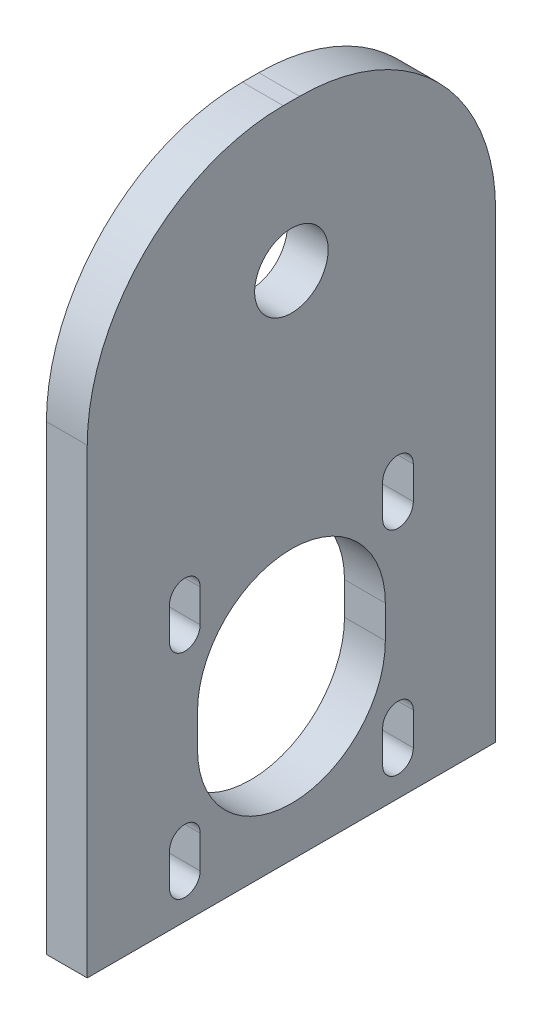
ISO-10303-21;
HEADER;
FILE_DESCRIPTION(('STEP AP214'),'2;1');
FILE_NAME('part.step','',(''),(''),'','','');
FILE_SCHEMA(('AUTOMOTIVE_DESIGN { 1 0 10303 214 1 1 1 1 }'));
ENDSEC;
DATA;
#1=APPLICATION_CONTEXT('core data for automotive mechanical design processes');
#2=APPLICATION_PROTOCOL_DEFINITION('international standard','automotive_design',2000,#1);
#3=PRODUCT_CONTEXT('',#1,'mechanical');
#4=PRODUCT('Part','Part','',(#3));
#5=PRODUCT_RELATED_PRODUCT_CATEGORY('part','',(#4));
#6=PRODUCT_DEFINITION_FORMATION('','',#4);
#7=PRODUCT_DEFINITION_CONTEXT('part definition',#1,'design');
#8=PRODUCT_DEFINITION('design','',#6,#7);
#9=PRODUCT_DEFINITION_SHAPE('','',#8);
#10=(LENGTH_UNIT() NAMED_UNIT(*) SI_UNIT(.MILLI.,.METRE.));
#11=(NAMED_UNIT(*) PLANE_ANGLE_UNIT() SI_UNIT($,.RADIAN.));
#12=(NAMED_UNIT(*) SI_UNIT($,.STERADIAN.) SOLID_ANGLE_UNIT());
#13=UNCERTAINTY_MEASURE_WITH_UNIT(LENGTH_MEASURE(1.E-05),#10,'distance_accuracy_value','');
#14=(GEOMETRIC_REPRESENTATION_CONTEXT(3) GLOBAL_UNCERTAINTY_ASSIGNED_CONTEXT((#13)) GLOBAL_UNIT_ASSIGNED_CONTEXT((#10,
#11,#12)) REPRESENTATION_CONTEXT('',''));
#15=CARTESIAN_POINT('',(0.,0.,0.));
#16=DIRECTION('',(0.,0.,1.));
#17=DIRECTION('',(1.,0.,0.));
#18=AXIS2_PLACEMENT_3D('',#15,#16,#17);
#19=CARTESIAN_POINT('',(5.,-4.80862533692693,-9.3733715800595));
#20=DIRECTION('',(1.,0.,0.));
#21=DIRECTION('',(0.,0.,-1.));
#22=AXIS2_PLACEMENT_3D('',#19,#20,#21);
#23=PLANE('',#22);
#24=DIRECTION('',(0.,1.,0.));
#25=VECTOR('',#24,1.);
#26=CARTESIAN_POINT('',(5.,-4.80862533692693,-35.3733715800595));
#27=LINE('',#26,#25);
#28=CARTESIAN_POINT('',(5.,-61.3086253369269,-35.3733715800595));
#29=VERTEX_POINT('',#28);
#30=CARTESIAN_POINT('',(5.,-4.80862533692693,-35.3733715800595));
#31=VERTEX_POINT('',#30);
#32=EDGE_CURVE('E373',#29,#31,#27,.T.);
#33=ORIENTED_EDGE('',*,*,#32,.T.);
#34=CARTESIAN_POINT('',(5.,-4.80862533692693,-11.3733715800595));
#35=DIRECTION('',(1.,0.,0.));
#36=DIRECTION('',(0.,0.,1.));
#37=AXIS2_PLACEMENT_3D('',#34,#35,#36);
#38=CIRCLE('',#37,24.);
#39=CARTESIAN_POINT('',(5.,19.1913746630731,-11.3733715800595));
#40=VERTEX_POINT('',#39);
#41=EDGE_CURVE('E376',#31,#40,#38,.T.);
#42=ORIENTED_EDGE('',*,*,#41,.T.);
#43=DIRECTION('',(0.,0.,1.));
#44=VECTOR('',#43,1.);
#45=CARTESIAN_POINT('',(5.,19.1913746630731,-9.3733715800595));
#46=LINE('',#45,#44);
#47=CARTESIAN_POINT('',(5.,19.1913746630731,-9.3733715800595));
#48=VERTEX_POINT('',#47);
#49=EDGE_CURVE('E379',#40,#48,#46,.T.);
#50=ORIENTED_EDGE('',*,*,#49,.T.);
#51=CARTESIAN_POINT('',(5.,-4.80862533692693,-9.3733715800595));
#52=DIRECTION('',(1.,0.,0.));
#53=DIRECTION('',(0.,0.,-1.));
#54=AXIS2_PLACEMENT_3D('',#51,#52,#53);
#55=CIRCLE('',#54,24.);
#56=CARTESIAN_POINT('',(5.,-4.80862533692693,14.6266284199405));
#57=VERTEX_POINT('',#56);
#58=EDGE_CURVE('E381',#48,#57,#55,.T.);
#59=ORIENTED_EDGE('',*,*,#58,.T.);
#60=DIRECTION('',(0.,-1.,0.));
#61=VECTOR('',#60,1.);
#62=CARTESIAN_POINT('',(5.,-4.80862533692693,14.6266284199405));
#63=LINE('',#62,#61);
#64=CARTESIAN_POINT('',(5.,-61.3086253369269,14.6266284199405));
#65=VERTEX_POINT('',#64);
#66=EDGE_CURVE('E383',#57,#65,#63,.T.);
#67=ORIENTED_EDGE('',*,*,#66,.T.);
#68=DIRECTION('',(0.,0.,-1.));
#69=VECTOR('',#68,1.);
#70=CARTESIAN_POINT('',(5.,-61.3086253369269,14.6266284199405));
#71=LINE('',#70,#69);
#72=EDGE_CURVE('E385',#65,#29,#71,.T.);
#73=ORIENTED_EDGE('',*,*,#72,.T.);
#74=EDGE_LOOP('',(#33,#42,#50,#59,#67,#73));
#75=FACE_BOUND('',#74,.T.);
#76=CARTESIAN_POINT('',(5.,1.19137466307307,-10.3733715800595));
#77=DIRECTION('',(1.,0.,0.));
#78=DIRECTION('',(0.,0.,-1.));
#79=AXIS2_PLACEMENT_3D('',#76,#77,#78);
#80=CIRCLE('',#79,4.5);
#81=CARTESIAN_POINT('',(5.,1.19137466307307,-14.8733715800595));
#82=VERTEX_POINT('',#81);
#83=EDGE_CURVE('E367',#82,#82,#80,.T.);
#84=ORIENTED_EDGE('',*,*,#83,.F.);
#85=EDGE_LOOP('',(#84));
#86=FACE_BOUND('',#85,.T.);
#87=DIRECTION('',(0.,-1.,0.));
#88=VECTOR('',#87,1.);
#89=CARTESIAN_POINT('',(5.,-26.758625336927,4.55162841994051));
#90=LINE('',#89,#88);
#91=CARTESIAN_POINT('',(5.,-26.758625336927,4.55162841994051));
#92=VERTEX_POINT('',#91);
#93=CARTESIAN_POINT('',(5.,-30.7586253369269,4.55162841994051));
#94=VERTEX_POINT('',#93);
#95=EDGE_CURVE('E338',#92,#94,#90,.T.);
#96=ORIENTED_EDGE('',*,*,#95,.F.);
#97=CARTESIAN_POINT('',(5.,-26.758625336927,2.67662841994051));
#98=DIRECTION('',(1.,0.,0.));
#99=DIRECTION('',(0.,0.,-1.));
#100=AXIS2_PLACEMENT_3D('',#97,#98,#99);
#101=CIRCLE('',#100,1.875);
#102=CARTESIAN_POINT('',(5.,-26.758625336927,0.80162841994051));
#103=VERTEX_POINT('',#102);
#104=EDGE_CURVE('E336',#103,#92,#101,.T.);
#105=ORIENTED_EDGE('',*,*,#104,.F.);
#106=DIRECTION('',(0.,1.,0.));
#107=VECTOR('',#106,1.);
#108=CARTESIAN_POINT('',(5.,-26.758625336927,0.80162841994051));
#109=LINE('',#108,#107);
#110=CARTESIAN_POINT('',(5.,-30.758625336927,0.801628419940509));
#111=VERTEX_POINT('',#110);
#112=EDGE_CURVE('E344',#111,#103,#109,.T.);
#113=ORIENTED_EDGE('',*,*,#112,.F.);
#114=CARTESIAN_POINT('',(5.,-30.758625336927,2.6766284199405));
#115=DIRECTION('',(1.,0.,0.));
#116=DIRECTION('',(0.,0.,-1.));
#117=AXIS2_PLACEMENT_3D('',#114,#115,#116);
#118=CIRCLE('',#117,1.875);
#119=EDGE_CURVE('E341',#94,#111,#118,.T.);
#120=ORIENTED_EDGE('',*,*,#119,.F.);
#121=EDGE_LOOP('',(#96,#105,#113,#120));
#122=FACE_BOUND('',#121,.T.);
#123=DIRECTION('',(0.,-1.,0.));
#124=VECTOR('',#123,1.);
#125=CARTESIAN_POINT('',(5.,-26.7586253369269,-21.5483715800594));
#126=LINE('',#125,#124);
#127=CARTESIAN_POINT('',(5.,-26.7586253369269,-21.5483715800594));
#128=VERTEX_POINT('',#127);
#129=CARTESIAN_POINT('',(5.,-30.7586253369269,-21.5483715800595));
#130=VERTEX_POINT('',#129);
#131=EDGE_CURVE('E307',#128,#130,#126,.T.);
#132=ORIENTED_EDGE('',*,*,#131,.F.);
#133=CARTESIAN_POINT('',(5.,-26.7586253369269,-23.4233715800594));
#134=DIRECTION('',(1.,0.,0.));
#135=DIRECTION('',(0.,0.,-1.));
#136=AXIS2_PLACEMENT_3D('',#133,#134,#135);
#137=CIRCLE('',#136,1.87500000000001);
#138=CARTESIAN_POINT('',(5.,-26.7586253369269,-25.2983715800594));
#139=VERTEX_POINT('',#138);
#140=EDGE_CURVE('E305',#139,#128,#137,.T.);
#141=ORIENTED_EDGE('',*,*,#140,.F.);
#142=DIRECTION('',(0.,1.,0.));
#143=VECTOR('',#142,1.);
#144=CARTESIAN_POINT('',(5.,-26.7586253369269,-25.2983715800594));
#145=LINE('',#144,#143);
#146=CARTESIAN_POINT('',(5.,-30.7586253369269,-25.2983715800595));
#147=VERTEX_POINT('',#146);
#148=EDGE_CURVE('E313',#147,#139,#145,.T.);
#149=ORIENTED_EDGE('',*,*,#148,.F.);
#150=CARTESIAN_POINT('',(5.,-30.7586253369269,-23.4233715800594));
#151=DIRECTION('',(1.,0.,0.));
#152=DIRECTION('',(0.,0.,-1.));
#153=AXIS2_PLACEMENT_3D('',#150,#151,#152);
#154=CIRCLE('',#153,1.87500000000001);
#155=EDGE_CURVE('E310',#130,#147,#154,.T.);
#156=ORIENTED_EDGE('',*,*,#155,.F.);
#157=EDGE_LOOP('',(#132,#141,#149,#156));
#158=FACE_BOUND('',#157,.T.);
#159=DIRECTION('',(0.,-1.,0.));
#160=VECTOR('',#159,1.);
#161=CARTESIAN_POINT('',(5.,-52.858625336927,-21.5483715800595));
#162=LINE('',#161,#160);
#163=CARTESIAN_POINT('',(5.,-52.858625336927,-21.5483715800595));
#164=VERTEX_POINT('',#163);
#165=CARTESIAN_POINT('',(5.,-56.858625336927,-21.5483715800595));
#166=VERTEX_POINT('',#165);
#167=EDGE_CURVE('E276',#164,#166,#162,.T.);
#168=ORIENTED_EDGE('',*,*,#167,.F.);
#169=CARTESIAN_POINT('',(5.,-52.858625336927,-23.4233715800595));
#170=DIRECTION('',(1.,0.,0.));
#171=DIRECTION('',(0.,0.,-1.));
#172=AXIS2_PLACEMENT_3D('',#169,#170,#171);
#173=CIRCLE('',#172,1.875);
#174=CARTESIAN_POINT('',(5.,-52.858625336927,-25.2983715800595));
#175=VERTEX_POINT('',#174);
#176=EDGE_CURVE('E274',#175,#164,#173,.T.);
#177=ORIENTED_EDGE('',*,*,#176,.F.);
#178=DIRECTION('',(0.,1.,0.));
#179=VECTOR('',#178,1.);
#180=CARTESIAN_POINT('',(5.,-52.858625336927,-25.2983715800595));
#181=LINE('',#180,#179);
#182=CARTESIAN_POINT('',(5.,-56.858625336927,-25.2983715800595));
#183=VERTEX_POINT('',#182);
#184=EDGE_CURVE('E282',#183,#175,#181,.T.);
#185=ORIENTED_EDGE('',*,*,#184,.F.);
#186=CARTESIAN_POINT('',(5.,-56.858625336927,-23.4233715800595));
#187=DIRECTION('',(1.,0.,0.));
#188=DIRECTION('',(0.,0.,-1.));
#189=AXIS2_PLACEMENT_3D('',#186,#187,#188);
#190=CIRCLE('',#189,1.875);
#191=EDGE_CURVE('E279',#166,#183,#190,.T.);
#192=ORIENTED_EDGE('',*,*,#191,.F.);
#193=EDGE_LOOP('',(#168,#177,#185,#192));
#194=FACE_BOUND('',#193,.T.);
#195=DIRECTION('',(0.,-1.,0.));
#196=VECTOR('',#195,1.);
#197=CARTESIAN_POINT('',(5.,-52.858625336927,4.55162841994051));
#198=LINE('',#197,#196);
#199=CARTESIAN_POINT('',(5.,-52.858625336927,4.55162841994051));
#200=VERTEX_POINT('',#199);
#201=CARTESIAN_POINT('',(5.,-56.858625336927,4.55162841994051));
#202=VERTEX_POINT('',#201);
#203=EDGE_CURVE('E245',#200,#202,#198,.T.);
#204=ORIENTED_EDGE('',*,*,#203,.F.);
#205=CARTESIAN_POINT('',(5.,-52.858625336927,2.67662841994051));
#206=DIRECTION('',(1.,0.,0.));
#207=DIRECTION('',(0.,0.,-1.));
#208=AXIS2_PLACEMENT_3D('',#205,#206,#207);
#209=CIRCLE('',#208,1.875);
#210=CARTESIAN_POINT('',(5.,-52.858625336927,0.801628419940512));
#211=VERTEX_POINT('',#210);
#212=EDGE_CURVE('E243',#211,#200,#209,.T.);
#213=ORIENTED_EDGE('',*,*,#212,.F.);
#214=DIRECTION('',(0.,1.,0.));
#215=VECTOR('',#214,1.);
#216=CARTESIAN_POINT('',(5.,-52.858625336927,0.801628419940512));
#217=LINE('',#216,#215);
#218=CARTESIAN_POINT('',(5.,-56.858625336927,0.801628419940504));
#219=VERTEX_POINT('',#218);
#220=EDGE_CURVE('E251',#219,#211,#217,.T.);
#221=ORIENTED_EDGE('',*,*,#220,.F.);
#222=CARTESIAN_POINT('',(5.,-56.858625336927,2.6766284199405));
#223=DIRECTION('',(1.,0.,0.));
#224=DIRECTION('',(0.,0.,-1.));
#225=AXIS2_PLACEMENT_3D('',#222,#223,#224);
#226=CIRCLE('',#225,1.875);
#227=EDGE_CURVE('E248',#202,#219,#226,.T.);
#228=ORIENTED_EDGE('',*,*,#227,.F.);
#229=EDGE_LOOP('',(#204,#213,#221,#228));
#230=FACE_BOUND('',#229,.T.);
#231=DIRECTION('',(0.,-1.,0.));
#232=VECTOR('',#231,1.);
#233=CARTESIAN_POINT('',(5.,-39.808625336927,1.12662841994049));
#234=LINE('',#233,#232);
#235=CARTESIAN_POINT('',(5.,-39.808625336927,1.12662841994049));
#236=VERTEX_POINT('',#235);
#237=CARTESIAN_POINT('',(5.,-43.8086253369269,1.1266284199405));
#238=VERTEX_POINT('',#237);
#239=EDGE_CURVE('E213',#236,#238,#234,.T.);
#240=ORIENTED_EDGE('',*,*,#239,.F.);
#241=CARTESIAN_POINT('',(5.,-39.808625336927,-10.3733715800595));
#242=DIRECTION('',(1.,0.,0.));
#243=DIRECTION('',(0.,0.,-1.));
#244=AXIS2_PLACEMENT_3D('',#241,#242,#243);
#245=CIRCLE('',#244,11.5);
#246=CARTESIAN_POINT('',(5.,-39.808625336927,-21.8733715800595));
#247=VERTEX_POINT('',#246);
#248=EDGE_CURVE('E205',#247,#236,#245,.T.);
#249=ORIENTED_EDGE('',*,*,#248,.F.);
#250=DIRECTION('',(0.,1.,0.));
#251=VECTOR('',#250,1.);
#252=CARTESIAN_POINT('',(5.,-39.808625336927,-21.8733715800595));
#253=LINE('',#252,#251);
#254=CARTESIAN_POINT('',(5.,-43.8086253369269,-21.8733715800595));
#255=VERTEX_POINT('',#254);
#256=EDGE_CURVE('E227',#255,#247,#253,.T.);
#257=ORIENTED_EDGE('',*,*,#256,.F.);
#258=CARTESIAN_POINT('',(5.,-43.8086253369269,-10.3733715800595));
#259=DIRECTION('',(1.,0.,0.));
#260=DIRECTION('',(0.,0.,-1.));
#261=AXIS2_PLACEMENT_3D('',#258,#259,#260);
#262=CIRCLE('',#261,11.5);
#263=EDGE_CURVE('E225',#238,#255,#262,.T.);
#264=ORIENTED_EDGE('',*,*,#263,.F.);
#265=EDGE_LOOP('',(#240,#249,#257,#264));
#266=FACE_BOUND('',#265,.T.);
#267=ADVANCED_FACE('F32',(#75,#86,#122,#158,#194,#230,#266),#23,.T.);
#268=CARTESIAN_POINT('',(0.,-4.80862533692693,-9.3733715800595));
#269=DIRECTION('',(1.,0.,0.));
#270=DIRECTION('',(0.,0.,-1.));
#271=AXIS2_PLACEMENT_3D('',#268,#269,#270);
#272=PLANE('',#271);
#273=CARTESIAN_POINT('',(0.,-52.858625336927,2.67662841994051));
#274=DIRECTION('',(1.,0.,0.));
#275=DIRECTION('',(0.,0.,-1.));
#276=AXIS2_PLACEMENT_3D('',#273,#274,#275);
#277=CIRCLE('',#276,1.875);
#278=CARTESIAN_POINT('',(0.,-52.858625336927,0.801628419940512));
#279=VERTEX_POINT('',#278);
#280=CARTESIAN_POINT('',(0.,-52.858625336927,4.55162841994051));
#281=VERTEX_POINT('',#280);
#282=EDGE_CURVE('E221',#279,#281,#277,.T.);
#283=ORIENTED_EDGE('',*,*,#282,.T.);
#284=DIRECTION('',(0.,-1.,0.));
#285=VECTOR('',#284,1.);
#286=CARTESIAN_POINT('',(0.,-52.858625336927,4.55162841994051));
#287=LINE('',#286,#285);
#288=CARTESIAN_POINT('',(0.,-56.858625336927,4.55162841994051));
#289=VERTEX_POINT('',#288);
#290=EDGE_CURVE('E256',#281,#289,#287,.T.);
#291=ORIENTED_EDGE('',*,*,#290,.T.);
#292=CARTESIAN_POINT('',(0.,-56.858625336927,2.6766284199405));
#293=DIRECTION('',(1.,0.,0.));
#294=DIRECTION('',(0.,0.,-1.));
#295=AXIS2_PLACEMENT_3D('',#292,#293,#294);
#296=CIRCLE('',#295,1.875);
#297=CARTESIAN_POINT('',(0.,-56.858625336927,0.801628419940494));
#298=VERTEX_POINT('',#297);
#299=EDGE_CURVE('E259',#289,#298,#296,.T.);
#300=ORIENTED_EDGE('',*,*,#299,.T.);
#301=DIRECTION('',(0.,1.,0.));
#302=VECTOR('',#301,1.);
#303=CARTESIAN_POINT('',(0.,-52.858625336927,0.801628419940512));
#304=LINE('',#303,#302);
#305=EDGE_CURVE('E246',#298,#279,#304,.T.);
#306=ORIENTED_EDGE('',*,*,#305,.T.);
#307=EDGE_LOOP('',(#283,#291,#300,#306));
#308=FACE_BOUND('',#307,.T.);
#309=CARTESIAN_POINT('',(0.,-26.7586253369269,-23.4233715800594));
#310=DIRECTION('',(1.,0.,0.));
#311=DIRECTION('',(0.,0.,-1.));
#312=AXIS2_PLACEMENT_3D('',#309,#310,#311);
#313=CIRCLE('',#312,1.87500000000001);
#314=CARTESIAN_POINT('',(0.,-26.7586253369269,-25.2983715800594));
#315=VERTEX_POINT('',#314);
#316=CARTESIAN_POINT('',(0.,-26.7586253369269,-21.5483715800594));
#317=VERTEX_POINT('',#316);
#318=EDGE_CURVE('E304',#315,#317,#313,.T.);
#319=ORIENTED_EDGE('',*,*,#318,.T.);
#320=DIRECTION('',(0.,-1.,0.));
#321=VECTOR('',#320,1.);
#322=CARTESIAN_POINT('',(0.,-26.7586253369269,-21.5483715800594));
#323=LINE('',#322,#321);
#324=CARTESIAN_POINT('',(0.,-30.7586253369269,-21.5483715800595));
#325=VERTEX_POINT('',#324);
#326=EDGE_CURVE('E318',#317,#325,#323,.T.);
#327=ORIENTED_EDGE('',*,*,#326,.T.);
#328=CARTESIAN_POINT('',(0.,-30.7586253369269,-23.4233715800594));
#329=DIRECTION('',(1.,0.,0.));
#330=DIRECTION('',(0.,0.,-1.));
#331=AXIS2_PLACEMENT_3D('',#328,#329,#330);
#332=CIRCLE('',#331,1.87500000000001);
#333=CARTESIAN_POINT('',(0.,-30.7586253369269,-25.2983715800594));
#334=VERTEX_POINT('',#333);
#335=EDGE_CURVE('E321',#325,#334,#332,.T.);
#336=ORIENTED_EDGE('',*,*,#335,.T.);
#337=DIRECTION('',(0.,1.,0.));
#338=VECTOR('',#337,1.);
#339=CARTESIAN_POINT('',(0.,-26.7586253369269,-25.2983715800594));
#340=LINE('',#339,#338);
#341=EDGE_CURVE('E308',#334,#315,#340,.T.);
#342=ORIENTED_EDGE('',*,*,#341,.T.);
#343=EDGE_LOOP('',(#319,#327,#336,#342));
#344=FACE_BOUND('',#343,.T.);
#345=CARTESIAN_POINT('',(0.,1.19137466307307,-10.3733715800595));
#346=DIRECTION('',(1.,0.,0.));
#347=DIRECTION('',(0.,0.,-1.));
#348=AXIS2_PLACEMENT_3D('',#345,#346,#347);
#349=CIRCLE('',#348,4.5);
#350=CARTESIAN_POINT('',(0.,1.19137466307307,-14.8733715800595));
#351=VERTEX_POINT('',#350);
#352=EDGE_CURVE('E366',#351,#351,#349,.T.);
#353=ORIENTED_EDGE('',*,*,#352,.T.);
#354=EDGE_LOOP('',(#353));
#355=FACE_BOUND('',#354,.T.);
#356=DIRECTION('',(0.,1.,0.));
#357=VECTOR('',#356,1.);
#358=CARTESIAN_POINT('',(0.,-4.80862533692693,-35.3733715800595));
#359=LINE('',#358,#357);
#360=CARTESIAN_POINT('',(0.,-61.3086253369269,-35.3733715800595));
#361=VERTEX_POINT('',#360);
#362=CARTESIAN_POINT('',(0.,-4.80862533692693,-35.3733715800595));
#363=VERTEX_POINT('',#362);
#364=EDGE_CURVE('E370',#361,#363,#359,.T.);
#365=ORIENTED_EDGE('',*,*,#364,.F.);
#366=DIRECTION('',(0.,0.,-1.));
#367=VECTOR('',#366,1.);
#368=CARTESIAN_POINT('',(0.,-61.3086253369269,14.6266284199405));
#369=LINE('',#368,#367);
#370=CARTESIAN_POINT('',(0.,-61.3086253369269,14.6266284199405));
#371=VERTEX_POINT('',#370);
#372=EDGE_CURVE('E377',#371,#361,#369,.T.);
#373=ORIENTED_EDGE('',*,*,#372,.F.);
#374=DIRECTION('',(0.,-1.,0.));
#375=VECTOR('',#374,1.);
#376=CARTESIAN_POINT('',(0.,-4.80862533692693,14.6266284199405));
#377=LINE('',#376,#375);
#378=CARTESIAN_POINT('',(0.,-4.80862533692693,14.6266284199405));
#379=VERTEX_POINT('',#378);
#380=EDGE_CURVE('E396',#379,#371,#377,.T.);
#381=ORIENTED_EDGE('',*,*,#380,.F.);
#382=CARTESIAN_POINT('',(0.,-4.80862533692693,-9.3733715800595));
#383=DIRECTION('',(1.,0.,0.));
#384=DIRECTION('',(0.,0.,-1.));
#385=AXIS2_PLACEMENT_3D('',#382,#383,#384);
#386=CIRCLE('',#385,24.);
#387=CARTESIAN_POINT('',(0.,19.1913746630731,-9.3733715800595));
#388=VERTEX_POINT('',#387);
#389=EDGE_CURVE('E394',#388,#379,#386,.T.);
#390=ORIENTED_EDGE('',*,*,#389,.F.);
#391=DIRECTION('',(0.,0.,1.));
#392=VECTOR('',#391,1.);
#393=CARTESIAN_POINT('',(0.,19.1913746630731,-9.3733715800595));
#394=LINE('',#393,#392);
#395=CARTESIAN_POINT('',(0.,19.1913746630731,-11.3733715800595));
#396=VERTEX_POINT('',#395);
#397=EDGE_CURVE('E392',#396,#388,#394,.T.);
#398=ORIENTED_EDGE('',*,*,#397,.F.);
#399=CARTESIAN_POINT('',(0.,-4.80862533692693,-11.3733715800595));
#400=DIRECTION('',(1.,0.,0.));
#401=DIRECTION('',(0.,0.,1.));
#402=AXIS2_PLACEMENT_3D('',#399,#400,#401);
#403=CIRCLE('',#402,24.);
#404=EDGE_CURVE('E390',#363,#396,#403,.T.);
#405=ORIENTED_EDGE('',*,*,#404,.F.);
#406=EDGE_LOOP('',(#365,#373,#381,#390,#398,#405));
#407=FACE_BOUND('',#406,.T.);
#408=CARTESIAN_POINT('',(0.,-26.758625336927,2.67662841994051));
#409=DIRECTION('',(1.,0.,0.));
#410=DIRECTION('',(0.,0.,-1.));
#411=AXIS2_PLACEMENT_3D('',#408,#409,#410);
#412=CIRCLE('',#411,1.875);
#413=CARTESIAN_POINT('',(0.,-26.758625336927,0.80162841994051));
#414=VERTEX_POINT('',#413);
#415=CARTESIAN_POINT('',(0.,-26.758625336927,4.55162841994051));
#416=VERTEX_POINT('',#415);
#417=EDGE_CURVE('E335',#414,#416,#412,.T.);
#418=ORIENTED_EDGE('',*,*,#417,.T.);
#419=DIRECTION('',(0.,-1.,0.));
#420=VECTOR('',#419,1.);
#421=CARTESIAN_POINT('',(0.,-26.758625336927,4.55162841994051));
#422=LINE('',#421,#420);
#423=CARTESIAN_POINT('',(0.,-30.7586253369269,4.55162841994051));
#424=VERTEX_POINT('',#423);
#425=EDGE_CURVE('E349',#416,#424,#422,.T.);
#426=ORIENTED_EDGE('',*,*,#425,.T.);
#427=CARTESIAN_POINT('',(0.,-30.758625336927,2.6766284199405));
#428=DIRECTION('',(1.,0.,0.));
#429=DIRECTION('',(0.,0.,-1.));
#430=AXIS2_PLACEMENT_3D('',#427,#428,#429);
#431=CIRCLE('',#430,1.875);
#432=CARTESIAN_POINT('',(0.,-30.758625336927,0.801628419940497));
#433=VERTEX_POINT('',#432);
#434=EDGE_CURVE('E352',#424,#433,#431,.T.);
#435=ORIENTED_EDGE('',*,*,#434,.T.);
#436=DIRECTION('',(0.,1.,0.));
#437=VECTOR('',#436,1.);
#438=CARTESIAN_POINT('',(0.,-26.758625336927,0.80162841994051));
#439=LINE('',#438,#437);
#440=EDGE_CURVE('E339',#433,#414,#439,.T.);
#441=ORIENTED_EDGE('',*,*,#440,.T.);
#442=EDGE_LOOP('',(#418,#426,#435,#441));
#443=FACE_BOUND('',#442,.T.);
#444=CARTESIAN_POINT('',(0.,-52.858625336927,-23.4233715800595));
#445=DIRECTION('',(1.,0.,0.));
#446=DIRECTION('',(0.,0.,-1.));
#447=AXIS2_PLACEMENT_3D('',#444,#445,#446);
#448=CIRCLE('',#447,1.875);
#449=CARTESIAN_POINT('',(0.,-52.858625336927,-25.2983715800595));
#450=VERTEX_POINT('',#449);
#451=CARTESIAN_POINT('',(0.,-52.858625336927,-21.5483715800595));
#452=VERTEX_POINT('',#451);
#453=EDGE_CURVE('E273',#450,#452,#448,.T.);
#454=ORIENTED_EDGE('',*,*,#453,.T.);
#455=DIRECTION('',(0.,-1.,0.));
#456=VECTOR('',#455,1.);
#457=CARTESIAN_POINT('',(0.,-52.858625336927,-21.5483715800595));
#458=LINE('',#457,#456);
#459=CARTESIAN_POINT('',(0.,-56.858625336927,-21.5483715800595));
#460=VERTEX_POINT('',#459);
#461=EDGE_CURVE('E287',#452,#460,#458,.T.);
#462=ORIENTED_EDGE('',*,*,#461,.T.);
#463=CARTESIAN_POINT('',(0.,-56.858625336927,-23.4233715800595));
#464=DIRECTION('',(1.,0.,0.));
#465=DIRECTION('',(0.,0.,-1.));
#466=AXIS2_PLACEMENT_3D('',#463,#464,#465);
#467=CIRCLE('',#466,1.875);
#468=CARTESIAN_POINT('',(0.,-56.858625336927,-25.2983715800595));
#469=VERTEX_POINT('',#468);
#470=EDGE_CURVE('E290',#460,#469,#467,.T.);
#471=ORIENTED_EDGE('',*,*,#470,.T.);
#472=DIRECTION('',(0.,1.,0.));
#473=VECTOR('',#472,1.);
#474=CARTESIAN_POINT('',(0.,-52.858625336927,-25.2983715800595));
#475=LINE('',#474,#473);
#476=EDGE_CURVE('E277',#469,#450,#475,.T.);
#477=ORIENTED_EDGE('',*,*,#476,.T.);
#478=EDGE_LOOP('',(#454,#462,#471,#477));
#479=FACE_BOUND('',#478,.T.);
#480=CARTESIAN_POINT('',(0.,-39.808625336927,-10.3733715800595));
#481=DIRECTION('',(1.,0.,0.));
#482=DIRECTION('',(0.,0.,-1.));
#483=AXIS2_PLACEMENT_3D('',#480,#481,#482);
#484=CIRCLE('',#483,11.5);
#485=CARTESIAN_POINT('',(0.,-39.808625336927,-21.8733715800595));
#486=VERTEX_POINT('',#485);
#487=CARTESIAN_POINT('',(0.,-39.808625336927,1.12662841994049));
#488=VERTEX_POINT('',#487);
#489=EDGE_CURVE('E55',#486,#488,#484,.T.);
#490=ORIENTED_EDGE('',*,*,#489,.T.);
#491=DIRECTION('',(0.,-1.,0.));
#492=VECTOR('',#491,1.);
#493=CARTESIAN_POINT('',(0.,-39.808625336927,1.12662841994049));
#494=LINE('',#493,#492);
#495=CARTESIAN_POINT('',(0.,-43.8086253369269,1.1266284199405));
#496=VERTEX_POINT('',#495);
#497=EDGE_CURVE('E220',#488,#496,#494,.T.);
#498=ORIENTED_EDGE('',*,*,#497,.T.);
#499=CARTESIAN_POINT('',(0.,-43.8086253369269,-10.3733715800595));
#500=DIRECTION('',(1.,0.,0.));
#501=DIRECTION('',(0.,0.,-1.));
#502=AXIS2_PLACEMENT_3D('',#499,#500,#501);
#503=CIRCLE('',#502,11.5);
#504=CARTESIAN_POINT('',(0.,-43.8086253369269,-21.8733715800595));
#505=VERTEX_POINT('',#504);
#506=EDGE_CURVE('E235',#496,#505,#503,.T.);
#507=ORIENTED_EDGE('',*,*,#506,.T.);
#508=DIRECTION('',(0.,1.,0.));
#509=VECTOR('',#508,1.);
#510=CARTESIAN_POINT('',(0.,-39.808625336927,-21.8733715800595));
#511=LINE('',#510,#509);
#512=EDGE_CURVE('E214',#505,#486,#511,.T.);
#513=ORIENTED_EDGE('',*,*,#512,.T.);
#514=EDGE_LOOP('',(#490,#498,#507,#513));
#515=FACE_BOUND('',#514,.T.);
#516=ADVANCED_FACE('F420',(#308,#344,#355,#407,#443,#479,#515),#272,.F.);
#517=CARTESIAN_POINT('',(5.,-4.80862533692693,-35.3733715800595));
#518=DIRECTION('',(0.,0.,1.));
#519=DIRECTION('',(0.,-1.,0.));
#520=AXIS2_PLACEMENT_3D('',#517,#518,#519);
#521=PLANE('',#520);
#522=ORIENTED_EDGE('',*,*,#364,.T.);
#523=DIRECTION('',(-1.,0.,0.));
#524=VECTOR('',#523,1.);
#525=CARTESIAN_POINT('',(5.,-4.80862533692693,-35.3733715800595));
#526=LINE('',#525,#524);
#527=EDGE_CURVE('E11',#31,#363,#526,.T.);
#528=ORIENTED_EDGE('',*,*,#527,.F.);
#529=ORIENTED_EDGE('',*,*,#32,.F.);
#530=DIRECTION('',(-1.,0.,0.));
#531=VECTOR('',#530,1.);
#532=CARTESIAN_POINT('',(5.,-61.3086253369269,-35.3733715800595));
#533=LINE('',#532,#531);
#534=EDGE_CURVE('E387',#29,#361,#533,.T.);
#535=ORIENTED_EDGE('',*,*,#534,.T.);
#536=EDGE_LOOP('',(#522,#528,#529,#535));
#537=FACE_BOUND('',#536,.T.);
#538=ADVANCED_FACE('F34',(#537),#521,.F.);
#539=CARTESIAN_POINT('',(5.,-4.80862533692693,-11.3733715800595));
#540=DIRECTION('',(-1.,0.,0.));
#541=DIRECTION('',(0.,0.,1.));
#542=AXIS2_PLACEMENT_3D('',#539,#540,#541);
#543=CYLINDRICAL_SURFACE('',#542,24.);
#544=ORIENTED_EDGE('',*,*,#404,.T.);
#545=DIRECTION('',(-1.,0.,0.));
#546=VECTOR('',#545,1.);
#547=CARTESIAN_POINT('',(5.,19.1913746630731,-11.3733715800595));
#548=LINE('',#547,#546);
#549=EDGE_CURVE('E40',#40,#396,#548,.T.);
#550=ORIENTED_EDGE('',*,*,#549,.F.);
#551=ORIENTED_EDGE('',*,*,#41,.F.);
#552=ORIENTED_EDGE('',*,*,#527,.T.);
#553=EDGE_LOOP('',(#544,#550,#551,#552));
#554=FACE_BOUND('',#553,.T.);
#555=ADVANCED_FACE('F438',(#554),#543,.T.);
#556=CARTESIAN_POINT('',(5.,19.1913746630731,-9.3733715800595));
#557=DIRECTION('',(0.,-1.,0.));
#558=DIRECTION('',(0.,0.,-1.));
#559=AXIS2_PLACEMENT_3D('',#556,#557,#558);
#560=PLANE('',#559);
#561=ORIENTED_EDGE('',*,*,#397,.T.);
#562=DIRECTION('',(-1.,0.,0.));
#563=VECTOR('',#562,1.);
#564=CARTESIAN_POINT('',(5.,19.1913746630731,-9.3733715800595));
#565=LINE('',#564,#563);
#566=EDGE_CURVE('E407',#48,#388,#565,.T.);
#567=ORIENTED_EDGE('',*,*,#566,.F.);
#568=ORIENTED_EDGE('',*,*,#49,.F.);
#569=ORIENTED_EDGE('',*,*,#549,.T.);
#570=EDGE_LOOP('',(#561,#567,#568,#569));
#571=FACE_BOUND('',#570,.T.);
#572=ADVANCED_FACE('F414',(#571),#560,.F.);
#573=CARTESIAN_POINT('',(5.,-4.80862533692693,-9.3733715800595));
#574=DIRECTION('',(-1.,0.,0.));
#575=DIRECTION('',(0.,0.,1.));
#576=AXIS2_PLACEMENT_3D('',#573,#574,#575);
#577=CYLINDRICAL_SURFACE('',#576,24.);
#578=ORIENTED_EDGE('',*,*,#389,.T.);
#579=DIRECTION('',(-1.,0.,0.));
#580=VECTOR('',#579,1.);
#581=CARTESIAN_POINT('',(5.,-4.80862533692693,14.6266284199405));
#582=LINE('',#581,#580);
#583=EDGE_CURVE('E404',#57,#379,#582,.T.);
#584=ORIENTED_EDGE('',*,*,#583,.F.);
#585=ORIENTED_EDGE('',*,*,#58,.F.);
#586=ORIENTED_EDGE('',*,*,#566,.T.);
#587=EDGE_LOOP('',(#578,#584,#585,#586));
#588=FACE_BOUND('',#587,.T.);
#589=ADVANCED_FACE('F426',(#588),#577,.T.);
#590=CARTESIAN_POINT('',(5.,-4.80862533692693,14.6266284199405));
#591=DIRECTION('',(0.,0.,-1.));
#592=DIRECTION('',(0.,1.,0.));
#593=AXIS2_PLACEMENT_3D('',#590,#591,#592);
#594=PLANE('',#593);
#595=ORIENTED_EDGE('',*,*,#380,.T.);
#596=DIRECTION('',(-1.,0.,0.));
#597=VECTOR('',#596,1.);
#598=CARTESIAN_POINT('',(5.,-61.3086253369269,14.6266284199405));
#599=LINE('',#598,#597);
#600=EDGE_CURVE('E401',#65,#371,#599,.T.);
#601=ORIENTED_EDGE('',*,*,#600,.F.);
#602=ORIENTED_EDGE('',*,*,#66,.F.);
#603=ORIENTED_EDGE('',*,*,#583,.T.);
#604=EDGE_LOOP('',(#595,#601,#602,#603));
#605=FACE_BOUND('',#604,.T.);
#606=ADVANCED_FACE('F430',(#605),#594,.F.);
#607=CARTESIAN_POINT('',(5.,-61.3086253369269,14.6266284199405));
#608=DIRECTION('',(0.,1.,0.));
#609=DIRECTION('',(0.,0.,1.));
#610=AXIS2_PLACEMENT_3D('',#607,#608,#609);
#611=PLANE('',#610);
#612=CARTESIAN_POINT('',(2.49999999999999,-61.3086253369269,10.6266284199407));
#613=DIRECTION('',(0.,-1.,0.));
#614=DIRECTION('',(0.,0.,-1.));
#615=AXIS2_PLACEMENT_3D('',#612,#613,#614);
#616=CIRCLE('',#615,1.4);
#617=CARTESIAN_POINT('',(2.49999999999999,-61.3086253369269,9.22662841994073));
#618=VERTEX_POINT('',#617);
#619=EDGE_CURVE('E557',#618,#618,#616,.T.);
#620=ORIENTED_EDGE('',*,*,#619,.F.);
#621=EDGE_LOOP('',(#620));
#622=FACE_BOUND('',#621,.T.);
#623=CARTESIAN_POINT('',(2.5,-61.3086253369269,-31.3733715800593));
#624=DIRECTION('',(0.,-1.,0.));
#625=DIRECTION('',(0.,0.,-1.));
#626=AXIS2_PLACEMENT_3D('',#623,#624,#625);
#627=CIRCLE('',#626,1.4);
#628=CARTESIAN_POINT('',(2.5,-61.3086253369269,-32.7733715800593));
#629=VERTEX_POINT('',#628);
#630=EDGE_CURVE('E564',#629,#629,#627,.T.);
#631=ORIENTED_EDGE('',*,*,#630,.F.);
#632=EDGE_LOOP('',(#631));
#633=FACE_BOUND('',#632,.T.);
#634=ORIENTED_EDGE('',*,*,#372,.T.);
#635=ORIENTED_EDGE('',*,*,#534,.F.);
#636=ORIENTED_EDGE('',*,*,#72,.F.);
#637=ORIENTED_EDGE('',*,*,#600,.T.);
#638=EDGE_LOOP('',(#634,#635,#636,#637));
#639=FACE_BOUND('',#638,.T.);
#640=ADVANCED_FACE('F441',(#622,#633,#639),#611,.F.);
#641=CARTESIAN_POINT('',(5.,1.19137466307307,-10.3733715800595));
#642=DIRECTION('',(-1.,0.,0.));
#643=DIRECTION('',(0.,0.,1.));
#644=AXIS2_PLACEMENT_3D('',#641,#642,#643);
#645=CYLINDRICAL_SURFACE('',#644,4.5);
#646=ORIENTED_EDGE('',*,*,#83,.T.);
#647=EDGE_LOOP('',(#646));
#648=FACE_BOUND('',#647,.T.);
#649=ORIENTED_EDGE('',*,*,#352,.F.);
#650=EDGE_LOOP('',(#649));
#651=FACE_BOUND('',#650,.T.);
#652=ADVANCED_FACE('F443',(#648,#651),#645,.F.);
#653=CARTESIAN_POINT('',(5.,-26.758625336927,2.67662841994051));
#654=DIRECTION('',(-1.,0.,0.));
#655=DIRECTION('',(0.,0.,1.));
#656=AXIS2_PLACEMENT_3D('',#653,#654,#655);
#657=CYLINDRICAL_SURFACE('',#656,1.875);
#658=ORIENTED_EDGE('',*,*,#417,.F.);
#659=DIRECTION('',(-1.,0.,0.));
#660=VECTOR('',#659,1.);
#661=CARTESIAN_POINT('',(5.,-26.758625336927,0.80162841994051));
#662=LINE('',#661,#660);
#663=EDGE_CURVE('E346',#103,#414,#662,.T.);
#664=ORIENTED_EDGE('',*,*,#663,.F.);
#665=ORIENTED_EDGE('',*,*,#104,.T.);
#666=DIRECTION('',(-1.,0.,0.));
#667=VECTOR('',#666,1.);
#668=CARTESIAN_POINT('',(5.,-26.758625336927,4.55162841994051));
#669=LINE('',#668,#667);
#670=EDGE_CURVE('E363',#92,#416,#669,.T.);
#671=ORIENTED_EDGE('',*,*,#670,.T.);
#672=EDGE_LOOP('',(#658,#664,#665,#671));
#673=FACE_BOUND('',#672,.T.);
#674=ADVANCED_FACE('F450',(#673),#657,.F.);
#675=CARTESIAN_POINT('',(5.,-26.758625336927,4.55162841994051));
#676=DIRECTION('',(0.,0.,-1.));
#677=DIRECTION('',(0.,1.,0.));
#678=AXIS2_PLACEMENT_3D('',#675,#676,#677);
#679=PLANE('',#678);
#680=ORIENTED_EDGE('',*,*,#425,.F.);
#681=ORIENTED_EDGE('',*,*,#670,.F.);
#682=ORIENTED_EDGE('',*,*,#95,.T.);
#683=DIRECTION('',(-1.,0.,0.));
#684=VECTOR('',#683,1.);
#685=CARTESIAN_POINT('',(5.,-30.7586253369269,4.55162841994051));
#686=LINE('',#685,#684);
#687=EDGE_CURVE('E361',#94,#424,#686,.T.);
#688=ORIENTED_EDGE('',*,*,#687,.T.);
#689=EDGE_LOOP('',(#680,#681,#682,#688));
#690=FACE_BOUND('',#689,.T.);
#691=ADVANCED_FACE('F466',(#690),#679,.T.);
#692=CARTESIAN_POINT('',(5.,-30.758625336927,2.6766284199405));
#693=DIRECTION('',(-1.,0.,0.));
#694=DIRECTION('',(0.,0.,1.));
#695=AXIS2_PLACEMENT_3D('',#692,#693,#694);
#696=CYLINDRICAL_SURFACE('',#695,1.875);
#697=ORIENTED_EDGE('',*,*,#434,.F.);
#698=ORIENTED_EDGE('',*,*,#687,.F.);
#699=ORIENTED_EDGE('',*,*,#119,.T.);
#700=DIRECTION('',(-1.,0.,0.));
#701=VECTOR('',#700,1.);
#702=CARTESIAN_POINT('',(5.,-30.758625336927,0.801628419940497));
#703=LINE('',#702,#701);
#704=EDGE_CURVE('E359',#111,#433,#703,.T.);
#705=ORIENTED_EDGE('',*,*,#704,.T.);
#706=EDGE_LOOP('',(#697,#698,#699,#705));
#707=FACE_BOUND('',#706,.T.);
#708=ADVANCED_FACE('F470',(#707),#696,.F.);
#709=CARTESIAN_POINT('',(5.,-26.758625336927,0.80162841994051));
#710=DIRECTION('',(0.,0.,1.));
#711=DIRECTION('',(0.,-1.,0.));
#712=AXIS2_PLACEMENT_3D('',#709,#710,#711);
#713=PLANE('',#712);
#714=ORIENTED_EDGE('',*,*,#440,.F.);
#715=ORIENTED_EDGE('',*,*,#704,.F.);
#716=ORIENTED_EDGE('',*,*,#112,.T.);
#717=ORIENTED_EDGE('',*,*,#663,.T.);
#718=EDGE_LOOP('',(#714,#715,#716,#717));
#719=FACE_BOUND('',#718,.T.);
#720=ADVANCED_FACE('F474',(#719),#713,.T.);
#721=CARTESIAN_POINT('',(5.,-26.7586253369269,-23.4233715800594));
#722=DIRECTION('',(-1.,0.,0.));
#723=DIRECTION('',(0.,0.,1.));
#724=AXIS2_PLACEMENT_3D('',#721,#722,#723);
#725=CYLINDRICAL_SURFACE('',#724,1.87500000000001);
#726=ORIENTED_EDGE('',*,*,#318,.F.);
#727=DIRECTION('',(-1.,0.,0.));
#728=VECTOR('',#727,1.);
#729=CARTESIAN_POINT('',(5.,-26.7586253369269,-25.2983715800594));
#730=LINE('',#729,#728);
#731=EDGE_CURVE('E315',#139,#315,#730,.T.);
#732=ORIENTED_EDGE('',*,*,#731,.F.);
#733=ORIENTED_EDGE('',*,*,#140,.T.);
#734=DIRECTION('',(-1.,0.,0.));
#735=VECTOR('',#734,1.);
#736=CARTESIAN_POINT('',(5.,-26.7586253369269,-21.5483715800594));
#737=LINE('',#736,#735);
#738=EDGE_CURVE('E332',#128,#317,#737,.T.);
#739=ORIENTED_EDGE('',*,*,#738,.T.);
#740=EDGE_LOOP('',(#726,#732,#733,#739));
#741=FACE_BOUND('',#740,.T.);
#742=ADVANCED_FACE('F478',(#741),#725,.F.);
#743=CARTESIAN_POINT('',(5.,-26.7586253369269,-21.5483715800594));
#744=DIRECTION('',(0.,0.,-1.));
#745=DIRECTION('',(0.,1.,0.));
#746=AXIS2_PLACEMENT_3D('',#743,#744,#745);
#747=PLANE('',#746);
#748=ORIENTED_EDGE('',*,*,#326,.F.);
#749=ORIENTED_EDGE('',*,*,#738,.F.);
#750=ORIENTED_EDGE('',*,*,#131,.T.);
#751=DIRECTION('',(-1.,0.,0.));
#752=VECTOR('',#751,1.);
#753=CARTESIAN_POINT('',(5.,-30.7586253369269,-21.5483715800595));
#754=LINE('',#753,#752);
#755=EDGE_CURVE('E330',#130,#325,#754,.T.);
#756=ORIENTED_EDGE('',*,*,#755,.T.);
#757=EDGE_LOOP('',(#748,#749,#750,#756));
#758=FACE_BOUND('',#757,.T.);
#759=ADVANCED_FACE('F482',(#758),#747,.T.);
#760=CARTESIAN_POINT('',(5.,-30.7586253369269,-23.4233715800594));
#761=DIRECTION('',(-1.,0.,0.));
#762=DIRECTION('',(0.,0.,1.));
#763=AXIS2_PLACEMENT_3D('',#760,#761,#762);
#764=CYLINDRICAL_SURFACE('',#763,1.87500000000001);
#765=ORIENTED_EDGE('',*,*,#335,.F.);
#766=ORIENTED_EDGE('',*,*,#755,.F.);
#767=ORIENTED_EDGE('',*,*,#155,.T.);
#768=DIRECTION('',(-1.,0.,0.));
#769=VECTOR('',#768,1.);
#770=CARTESIAN_POINT('',(5.,-30.7586253369269,-25.2983715800594));
#771=LINE('',#770,#769);
#772=EDGE_CURVE('E328',#147,#334,#771,.T.);
#773=ORIENTED_EDGE('',*,*,#772,.T.);
#774=EDGE_LOOP('',(#765,#766,#767,#773));
#775=FACE_BOUND('',#774,.T.);
#776=ADVANCED_FACE('F486',(#775),#764,.F.);
#777=CARTESIAN_POINT('',(5.,-26.7586253369269,-25.2983715800594));
#778=DIRECTION('',(0.,0.,1.));
#779=DIRECTION('',(0.,-1.,0.));
#780=AXIS2_PLACEMENT_3D('',#777,#778,#779);
#781=PLANE('',#780);
#782=ORIENTED_EDGE('',*,*,#341,.F.);
#783=ORIENTED_EDGE('',*,*,#772,.F.);
#784=ORIENTED_EDGE('',*,*,#148,.T.);
#785=ORIENTED_EDGE('',*,*,#731,.T.);
#786=EDGE_LOOP('',(#782,#783,#784,#785));
#787=FACE_BOUND('',#786,.T.);
#788=ADVANCED_FACE('F490',(#787),#781,.T.);
#789=CARTESIAN_POINT('',(5.,-52.858625336927,-23.4233715800595));
#790=DIRECTION('',(-1.,0.,0.));
#791=DIRECTION('',(0.,0.,1.));
#792=AXIS2_PLACEMENT_3D('',#789,#790,#791);
#793=CYLINDRICAL_SURFACE('',#792,1.875);
#794=ORIENTED_EDGE('',*,*,#453,.F.);
#795=DIRECTION('',(-1.,0.,0.));
#796=VECTOR('',#795,1.);
#797=CARTESIAN_POINT('',(5.,-52.858625336927,-25.2983715800595));
#798=LINE('',#797,#796);
#799=EDGE_CURVE('E284',#175,#450,#798,.T.);
#800=ORIENTED_EDGE('',*,*,#799,.F.);
#801=ORIENTED_EDGE('',*,*,#176,.T.);
#802=DIRECTION('',(-1.,0.,0.));
#803=VECTOR('',#802,1.);
#804=CARTESIAN_POINT('',(5.,-52.858625336927,-21.5483715800595));
#805=LINE('',#804,#803);
#806=EDGE_CURVE('E301',#164,#452,#805,.T.);
#807=ORIENTED_EDGE('',*,*,#806,.T.);
#808=EDGE_LOOP('',(#794,#800,#801,#807));
#809=FACE_BOUND('',#808,.T.);
#810=ADVANCED_FACE('F494',(#809),#793,.F.);
#811=CARTESIAN_POINT('',(5.,-52.858625336927,-21.5483715800595));
#812=DIRECTION('',(0.,0.,-1.));
#813=DIRECTION('',(-1.,0.,0.));
#814=AXIS2_PLACEMENT_3D('',#811,#812,#813);
#815=PLANE('',#814);
#816=ORIENTED_EDGE('',*,*,#461,.F.);
#817=ORIENTED_EDGE('',*,*,#806,.F.);
#818=ORIENTED_EDGE('',*,*,#167,.T.);
#819=DIRECTION('',(-1.,0.,0.));
#820=VECTOR('',#819,1.);
#821=CARTESIAN_POINT('',(5.,-56.858625336927,-21.5483715800595));
#822=LINE('',#821,#820);
#823=EDGE_CURVE('E299',#166,#460,#822,.T.);
#824=ORIENTED_EDGE('',*,*,#823,.T.);
#825=EDGE_LOOP('',(#816,#817,#818,#824));
#826=FACE_BOUND('',#825,.T.);
#827=ADVANCED_FACE('F498',(#826),#815,.T.);
#828=CARTESIAN_POINT('',(5.,-56.858625336927,-23.4233715800595));
#829=DIRECTION('',(-1.,0.,0.));
#830=DIRECTION('',(0.,0.,1.));
#831=AXIS2_PLACEMENT_3D('',#828,#829,#830);
#832=CYLINDRICAL_SURFACE('',#831,1.875);
#833=ORIENTED_EDGE('',*,*,#470,.F.);
#834=ORIENTED_EDGE('',*,*,#823,.F.);
#835=ORIENTED_EDGE('',*,*,#191,.T.);
#836=DIRECTION('',(-1.,0.,0.));
#837=VECTOR('',#836,1.);
#838=CARTESIAN_POINT('',(5.,-56.858625336927,-25.2983715800595));
#839=LINE('',#838,#837);
#840=EDGE_CURVE('E297',#183,#469,#839,.T.);
#841=ORIENTED_EDGE('',*,*,#840,.T.);
#842=EDGE_LOOP('',(#833,#834,#835,#841));
#843=FACE_BOUND('',#842,.T.);
#844=ADVANCED_FACE('F502',(#843),#832,.F.);
#845=CARTESIAN_POINT('',(5.,-52.858625336927,-25.2983715800595));
#846=DIRECTION('',(0.,0.,1.));
#847=DIRECTION('',(1.,0.,0.));
#848=AXIS2_PLACEMENT_3D('',#845,#846,#847);
#849=PLANE('',#848);
#850=ORIENTED_EDGE('',*,*,#476,.F.);
#851=ORIENTED_EDGE('',*,*,#840,.F.);
#852=ORIENTED_EDGE('',*,*,#184,.T.);
#853=ORIENTED_EDGE('',*,*,#799,.T.);
#854=EDGE_LOOP('',(#850,#851,#852,#853));
#855=FACE_BOUND('',#854,.T.);
#856=ADVANCED_FACE('F506',(#855),#849,.T.);
#857=CARTESIAN_POINT('',(5.,-52.858625336927,2.67662841994051));
#858=DIRECTION('',(-1.,0.,0.));
#859=DIRECTION('',(0.,0.,1.));
#860=AXIS2_PLACEMENT_3D('',#857,#858,#859);
#861=CYLINDRICAL_SURFACE('',#860,1.875);
#862=ORIENTED_EDGE('',*,*,#282,.F.);
#863=DIRECTION('',(-1.,0.,0.));
#864=VECTOR('',#863,1.);
#865=CARTESIAN_POINT('',(5.,-52.858625336927,0.801628419940512));
#866=LINE('',#865,#864);
#867=EDGE_CURVE('E253',#211,#279,#866,.T.);
#868=ORIENTED_EDGE('',*,*,#867,.F.);
#869=ORIENTED_EDGE('',*,*,#212,.T.);
#870=DIRECTION('',(-1.,0.,0.));
#871=VECTOR('',#870,1.);
#872=CARTESIAN_POINT('',(5.,-52.858625336927,4.55162841994051));
#873=LINE('',#872,#871);
#874=EDGE_CURVE('E270',#200,#281,#873,.T.);
#875=ORIENTED_EDGE('',*,*,#874,.T.);
#876=EDGE_LOOP('',(#862,#868,#869,#875));
#877=FACE_BOUND('',#876,.T.);
#878=ADVANCED_FACE('F510',(#877),#861,.F.);
#879=CARTESIAN_POINT('',(5.,-52.858625336927,4.55162841994051));
#880=DIRECTION('',(0.,0.,-1.));
#881=DIRECTION('',(0.,1.,0.));
#882=AXIS2_PLACEMENT_3D('',#879,#880,#881);
#883=PLANE('',#882);
#884=ORIENTED_EDGE('',*,*,#290,.F.);
#885=ORIENTED_EDGE('',*,*,#874,.F.);
#886=ORIENTED_EDGE('',*,*,#203,.T.);
#887=DIRECTION('',(-1.,0.,0.));
#888=VECTOR('',#887,1.);
#889=CARTESIAN_POINT('',(5.,-56.858625336927,4.55162841994051));
#890=LINE('',#889,#888);
#891=EDGE_CURVE('E268',#202,#289,#890,.T.);
#892=ORIENTED_EDGE('',*,*,#891,.T.);
#893=EDGE_LOOP('',(#884,#885,#886,#892));
#894=FACE_BOUND('',#893,.T.);
#895=ADVANCED_FACE('F514',(#894),#883,.T.);
#896=CARTESIAN_POINT('',(5.,-56.858625336927,2.6766284199405));
#897=DIRECTION('',(-1.,0.,0.));
#898=DIRECTION('',(0.,0.,1.));
#899=AXIS2_PLACEMENT_3D('',#896,#897,#898);
#900=CYLINDRICAL_SURFACE('',#899,1.875);
#901=ORIENTED_EDGE('',*,*,#299,.F.);
#902=ORIENTED_EDGE('',*,*,#891,.F.);
#903=ORIENTED_EDGE('',*,*,#227,.T.);
#904=DIRECTION('',(-1.,0.,0.));
#905=VECTOR('',#904,1.);
#906=CARTESIAN_POINT('',(5.,-56.858625336927,0.801628419940494));
#907=LINE('',#906,#905);
#908=EDGE_CURVE('E266',#219,#298,#907,.T.);
#909=ORIENTED_EDGE('',*,*,#908,.T.);
#910=EDGE_LOOP('',(#901,#902,#903,#909));
#911=FACE_BOUND('',#910,.T.);
#912=ADVANCED_FACE('F518',(#911),#900,.F.);
#913=CARTESIAN_POINT('',(5.,-52.858625336927,0.801628419940512));
#914=DIRECTION('',(0.,0.,1.));
#915=DIRECTION('',(0.,-1.,0.));
#916=AXIS2_PLACEMENT_3D('',#913,#914,#915);
#917=PLANE('',#916);
#918=ORIENTED_EDGE('',*,*,#305,.F.);
#919=ORIENTED_EDGE('',*,*,#908,.F.);
#920=ORIENTED_EDGE('',*,*,#220,.T.);
#921=ORIENTED_EDGE('',*,*,#867,.T.);
#922=EDGE_LOOP('',(#918,#919,#920,#921));
#923=FACE_BOUND('',#922,.T.);
#924=ADVANCED_FACE('F522',(#923),#917,.T.);
#925=CARTESIAN_POINT('',(5.,-39.808625336927,-10.3733715800595));
#926=DIRECTION('',(-1.,0.,0.));
#927=DIRECTION('',(0.,0.,1.));
#928=AXIS2_PLACEMENT_3D('',#925,#926,#927);
#929=CYLINDRICAL_SURFACE('',#928,11.5);
#930=ORIENTED_EDGE('',*,*,#489,.F.);
#931=DIRECTION('',(-1.,0.,0.));
#932=VECTOR('',#931,1.);
#933=CARTESIAN_POINT('',(5.,-39.808625336927,-21.8733715800595));
#934=LINE('',#933,#932);
#935=EDGE_CURVE('E209',#247,#486,#934,.T.);
#936=ORIENTED_EDGE('',*,*,#935,.F.);
#937=ORIENTED_EDGE('',*,*,#248,.T.);
#938=DIRECTION('',(-1.,0.,0.));
#939=VECTOR('',#938,1.);
#940=CARTESIAN_POINT('',(5.,-39.808625336927,1.12662841994049));
#941=LINE('',#940,#939);
#942=EDGE_CURVE('E208',#236,#488,#941,.T.);
#943=ORIENTED_EDGE('',*,*,#942,.T.);
#944=EDGE_LOOP('',(#930,#936,#937,#943));
#945=FACE_BOUND('',#944,.T.);
#946=ADVANCED_FACE('F207',(#945),#929,.F.);
#947=CARTESIAN_POINT('',(5.,-39.808625336927,1.12662841994049));
#948=DIRECTION('',(0.,0.,-1.));
#949=DIRECTION('',(0.,1.,0.));
#950=AXIS2_PLACEMENT_3D('',#947,#948,#949);
#951=PLANE('',#950);
#952=ORIENTED_EDGE('',*,*,#497,.F.);
#953=ORIENTED_EDGE('',*,*,#942,.F.);
#954=ORIENTED_EDGE('',*,*,#239,.T.);
#955=DIRECTION('',(-1.,0.,0.));
#956=VECTOR('',#955,1.);
#957=CARTESIAN_POINT('',(5.,-43.8086253369269,1.1266284199405));
#958=LINE('',#957,#956);
#959=EDGE_CURVE('E222',#238,#496,#958,.T.);
#960=ORIENTED_EDGE('',*,*,#959,.T.);
#961=EDGE_LOOP('',(#952,#953,#954,#960));
#962=FACE_BOUND('',#961,.T.);
#963=ADVANCED_FACE('F217',(#962),#951,.T.);
#964=CARTESIAN_POINT('',(5.,-43.8086253369269,-10.3733715800595));
#965=DIRECTION('',(-1.,0.,0.));
#966=DIRECTION('',(0.,0.,1.));
#967=AXIS2_PLACEMENT_3D('',#964,#965,#966);
#968=CYLINDRICAL_SURFACE('',#967,11.5);
#969=ORIENTED_EDGE('',*,*,#506,.F.);
#970=ORIENTED_EDGE('',*,*,#959,.F.);
#971=ORIENTED_EDGE('',*,*,#263,.T.);
#972=DIRECTION('',(-1.,0.,0.));
#973=VECTOR('',#972,1.);
#974=CARTESIAN_POINT('',(5.,-43.8086253369269,-21.8733715800595));
#975=LINE('',#974,#973);
#976=EDGE_CURVE('E47',#255,#505,#975,.T.);
#977=ORIENTED_EDGE('',*,*,#976,.T.);
#978=EDGE_LOOP('',(#969,#970,#971,#977));
#979=FACE_BOUND('',#978,.T.);
#980=ADVANCED_FACE('F531',(#979),#968,.F.);
#981=CARTESIAN_POINT('',(5.,-39.808625336927,-21.8733715800595));
#982=DIRECTION('',(0.,0.,1.));
#983=DIRECTION('',(0.,-1.,0.));
#984=AXIS2_PLACEMENT_3D('',#981,#982,#983);
#985=PLANE('',#984);
#986=ORIENTED_EDGE('',*,*,#512,.F.);
#987=ORIENTED_EDGE('',*,*,#976,.F.);
#988=ORIENTED_EDGE('',*,*,#256,.T.);
#989=ORIENTED_EDGE('',*,*,#935,.T.);
#990=EDGE_LOOP('',(#986,#987,#988,#989));
#991=FACE_BOUND('',#990,.T.);
#992=ADVANCED_FACE('F534',(#991),#985,.T.);
#993=CARTESIAN_POINT('',(2.5,-51.3086253369269,-31.3733715800593));
#994=DIRECTION('',(0.,-1.,0.));
#995=DIRECTION('',(0.,0.,-1.));
#996=AXIS2_PLACEMENT_3D('',#993,#994,#995);
#997=CYLINDRICAL_SURFACE('',#996,1.4);
#998=CARTESIAN_POINT('',(2.5,-51.3086253369269,-31.3733715800593));
#999=DIRECTION('',(0.,-1.,0.));
#1000=DIRECTION('',(0.,0.,-1.));
#1001=AXIS2_PLACEMENT_3D('',#998,#999,#1000);
#1002=CIRCLE('',#1001,1.4);
#1003=CARTESIAN_POINT('',(2.5,-51.3086253369269,-32.7733715800593));
#1004=VERTEX_POINT('',#1003);
#1005=EDGE_CURVE('E560',#1004,#1004,#1002,.T.);
#1006=ORIENTED_EDGE('',*,*,#1005,.F.);
#1007=EDGE_LOOP('',(#1006));
#1008=FACE_BOUND('',#1007,.T.);
#1009=ORIENTED_EDGE('',*,*,#630,.T.);
#1010=EDGE_LOOP('',(#1009));
#1011=FACE_BOUND('',#1010,.T.);
#1012=ADVANCED_FACE('F538',(#1008,#1011),#997,.F.);
#1013=CARTESIAN_POINT('',(2.5,-51.3086253369269,-31.3733715800593));
#1014=DIRECTION('',(0.,-1.,0.));
#1015=DIRECTION('',(0.,0.,-1.));
#1016=AXIS2_PLACEMENT_3D('',#1013,#1014,#1015);
#1017=PLANE('',#1016);
#1018=ORIENTED_EDGE('',*,*,#1005,.T.);
#1019=EDGE_LOOP('',(#1018));
#1020=FACE_BOUND('',#1019,.T.);
#1021=ADVANCED_FACE('F541',(#1020),#1017,.T.);
#1022=CARTESIAN_POINT('',(2.49999999999999,-51.3086253369269,10.6266284199407));
#1023=DIRECTION('',(0.,-1.,0.));
#1024=DIRECTION('',(0.,0.,-1.));
#1025=AXIS2_PLACEMENT_3D('',#1022,#1023,#1024);
#1026=CYLINDRICAL_SURFACE('',#1025,1.4);
#1027=CARTESIAN_POINT('',(2.49999999999999,-51.3086253369269,10.6266284199407));
#1028=DIRECTION('',(0.,-1.,0.));
#1029=DIRECTION('',(0.,0.,-1.));
#1030=AXIS2_PLACEMENT_3D('',#1027,#1028,#1029);
#1031=CIRCLE('',#1030,1.4);
#1032=CARTESIAN_POINT('',(2.49999999999999,-51.3086253369269,9.22662841994073));
#1033=VERTEX_POINT('',#1032);
#1034=EDGE_CURVE('E233',#1033,#1033,#1031,.T.);
#1035=ORIENTED_EDGE('',*,*,#1034,.F.);
#1036=EDGE_LOOP('',(#1035));
#1037=FACE_BOUND('',#1036,.T.);
#1038=ORIENTED_EDGE('',*,*,#619,.T.);
#1039=EDGE_LOOP('',(#1038));
#1040=FACE_BOUND('',#1039,.T.);
#1041=ADVANCED_FACE('F545',(#1037,#1040),#1026,.F.);
#1042=CARTESIAN_POINT('',(2.49999999999999,-51.3086253369269,10.6266284199407));
#1043=DIRECTION('',(0.,-1.,0.));
#1044=DIRECTION('',(0.,0.,-1.));
#1045=AXIS2_PLACEMENT_3D('',#1042,#1043,#1044);
#1046=PLANE('',#1045);
#1047=ORIENTED_EDGE('',*,*,#1034,.T.);
#1048=EDGE_LOOP('',(#1047));
#1049=FACE_BOUND('',#1048,.T.);
#1050=ADVANCED_FACE('F549',(#1049),#1046,.T.);
#1051=CLOSED_SHELL('',(#267,#516,#538,#555,#572,#589,#606,#640,#652,#674,#691,#708,#720,#742,
#759,#776,#788,#810,#827,#844,#856,#878,#895,#912,#924,#946,#963,#980,#992,#1012,#1021,#1041,#1050));
#1052=MANIFOLD_SOLID_BREP('B2',#1051);
#1053=ADVANCED_BREP_SHAPE_REPRESENTATION('',(#18,#1052),#14);
#1054=SHAPE_DEFINITION_REPRESENTATION(#9,#1053);
ENDSEC;
END-ISO-10303-21;
